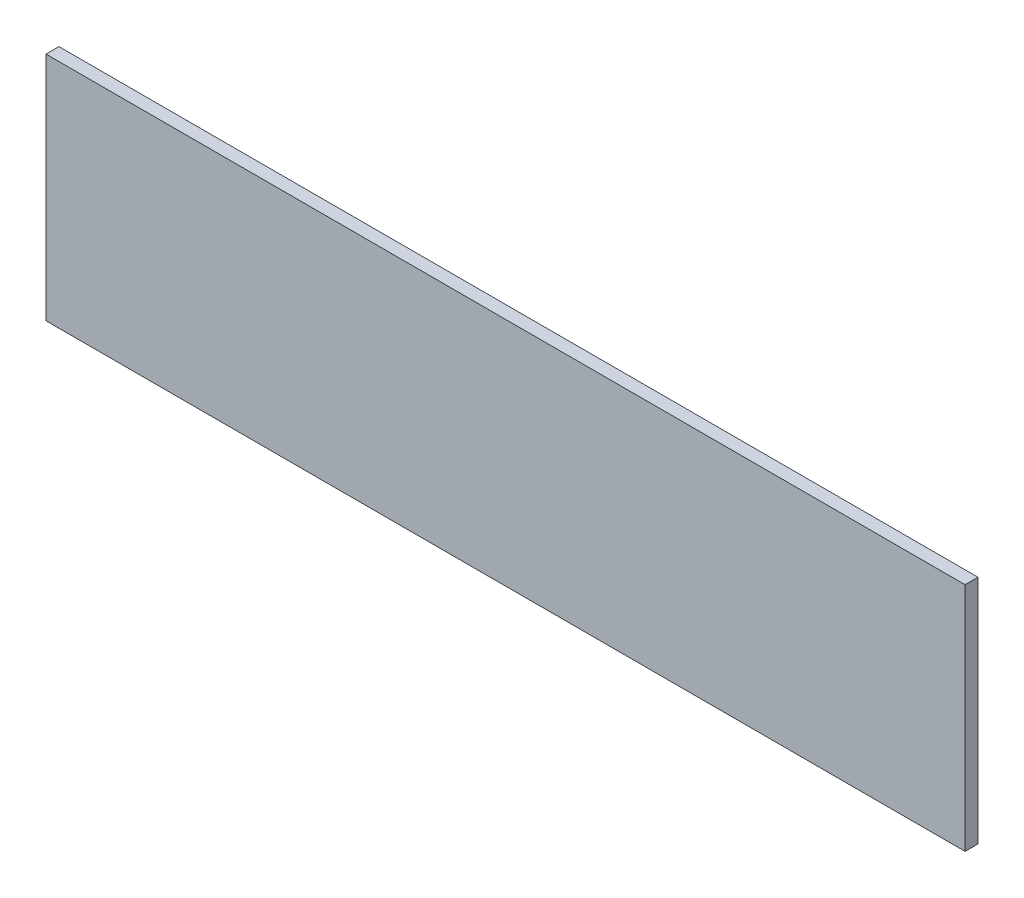
ISO-10303-21;
HEADER;
FILE_DESCRIPTION(('STEP AP214'),'2;1');
FILE_NAME('part.step','',(''),(''),'','','');
FILE_SCHEMA(('AUTOMOTIVE_DESIGN { 1 0 10303 214 1 1 1 1 }'));
ENDSEC;
DATA;
#1=APPLICATION_CONTEXT('core data for automotive mechanical design processes');
#2=APPLICATION_PROTOCOL_DEFINITION('international standard','automotive_design',2000,#1);
#3=PRODUCT_CONTEXT('',#1,'mechanical');
#4=PRODUCT('Part','Part','',(#3));
#5=PRODUCT_RELATED_PRODUCT_CATEGORY('part','',(#4));
#6=PRODUCT_DEFINITION_FORMATION('','',#4);
#7=PRODUCT_DEFINITION_CONTEXT('part definition',#1,'design');
#8=PRODUCT_DEFINITION('design','',#6,#7);
#9=PRODUCT_DEFINITION_SHAPE('','',#8);
#10=(LENGTH_UNIT() NAMED_UNIT(*) SI_UNIT(.MILLI.,.METRE.));
#11=(NAMED_UNIT(*) PLANE_ANGLE_UNIT() SI_UNIT($,.RADIAN.));
#12=(NAMED_UNIT(*) SI_UNIT($,.STERADIAN.) SOLID_ANGLE_UNIT());
#13=UNCERTAINTY_MEASURE_WITH_UNIT(LENGTH_MEASURE(1.E-05),#10,'distance_accuracy_value','');
#14=(GEOMETRIC_REPRESENTATION_CONTEXT(3) GLOBAL_UNCERTAINTY_ASSIGNED_CONTEXT((#13)) GLOBAL_UNIT_ASSIGNED_CONTEXT((#10,
#11,#12)) REPRESENTATION_CONTEXT('',''));
#15=CARTESIAN_POINT('',(0.,0.,0.));
#16=DIRECTION('',(0.,0.,1.));
#17=DIRECTION('',(1.,0.,0.));
#18=AXIS2_PLACEMENT_3D('',#15,#16,#17);
#19=CARTESIAN_POINT('',(0.9015984,0.22659848,0.));
#20=DIRECTION('',(1.,0.,0.));
#21=DIRECTION('',(0.,-1.,0.));
#22=AXIS2_PLACEMENT_3D('',#19,#20,#21);
#23=PLANE('',#22);
#24=DIRECTION('',(0.,0.,1.));
#25=VECTOR('',#24,1.);
#26=CARTESIAN_POINT('',(0.9015984,0.22659848,0.));
#27=LINE('',#26,#25);
#28=CARTESIAN_POINT('',(0.9015984,0.22659848,0.));
#29=VERTEX_POINT('',#28);
#30=CARTESIAN_POINT('',(0.9015984,0.22659848,0.0254));
#31=VERTEX_POINT('',#30);
#32=EDGE_CURVE('E11',#29,#31,#27,.T.);
#33=ORIENTED_EDGE('',*,*,#32,.T.);
#34=DIRECTION('',(0.,-1.,0.));
#35=VECTOR('',#34,1.);
#36=CARTESIAN_POINT('',(0.9015984,0.22659848,0.0254));
#37=LINE('',#36,#35);
#38=CARTESIAN_POINT('',(0.9015984,-0.22659848,0.0254));
#39=VERTEX_POINT('',#38);
#40=EDGE_CURVE('E24',#31,#39,#37,.T.);
#41=ORIENTED_EDGE('',*,*,#40,.T.);
#42=DIRECTION('',(0.,0.,1.));
#43=VECTOR('',#42,1.);
#44=CARTESIAN_POINT('',(0.9015984,-0.22659848,0.));
#45=LINE('',#44,#43);
#46=CARTESIAN_POINT('',(0.9015984,-0.22659848,0.));
#47=VERTEX_POINT('',#46);
#48=EDGE_CURVE('E85',#47,#39,#45,.T.);
#49=ORIENTED_EDGE('',*,*,#48,.F.);
#50=DIRECTION('',(0.,-1.,0.));
#51=VECTOR('',#50,1.);
#52=CARTESIAN_POINT('',(0.9015984,0.22659848,0.));
#53=LINE('',#52,#51);
#54=EDGE_CURVE('E83',#29,#47,#53,.T.);
#55=ORIENTED_EDGE('',*,*,#54,.F.);
#56=EDGE_LOOP('',(#33,#41,#49,#55));
#57=FACE_BOUND('',#56,.T.);
#58=ADVANCED_FACE('F17',(#57),#23,.T.);
#59=CARTESIAN_POINT('',(0.9015984,-0.22659848,0.));
#60=DIRECTION('',(0.,-1.,0.));
#61=DIRECTION('',(-1.,0.,0.));
#62=AXIS2_PLACEMENT_3D('',#59,#60,#61);
#63=PLANE('',#62);
#64=ORIENTED_EDGE('',*,*,#48,.T.);
#65=DIRECTION('',(-1.,0.,0.));
#66=VECTOR('',#65,1.);
#67=CARTESIAN_POINT('',(0.9015984,-0.22659848,0.0254));
#68=LINE('',#67,#66);
#69=CARTESIAN_POINT('',(-0.9015984,-0.22659848,0.0254));
#70=VERTEX_POINT('',#69);
#71=EDGE_CURVE('E81',#39,#70,#68,.T.);
#72=ORIENTED_EDGE('',*,*,#71,.T.);
#73=DIRECTION('',(0.,0.,1.));
#74=VECTOR('',#73,1.);
#75=CARTESIAN_POINT('',(-0.9015984,-0.22659848,0.));
#76=LINE('',#75,#74);
#77=CARTESIAN_POINT('',(-0.9015984,-0.22659848,0.));
#78=VERTEX_POINT('',#77);
#79=EDGE_CURVE('E79',#78,#70,#76,.T.);
#80=ORIENTED_EDGE('',*,*,#79,.F.);
#81=DIRECTION('',(-1.,0.,0.));
#82=VECTOR('',#81,1.);
#83=CARTESIAN_POINT('',(0.9015984,-0.22659848,0.));
#84=LINE('',#83,#82);
#85=EDGE_CURVE('E70',#47,#78,#84,.T.);
#86=ORIENTED_EDGE('',*,*,#85,.F.);
#87=EDGE_LOOP('',(#64,#72,#80,#86));
#88=FACE_BOUND('',#87,.T.);
#89=ADVANCED_FACE('F90',(#88),#63,.T.);
#90=CARTESIAN_POINT('',(-0.9015984,-0.22659848,0.));
#91=DIRECTION('',(-1.,0.,0.));
#92=DIRECTION('',(0.,1.,0.));
#93=AXIS2_PLACEMENT_3D('',#90,#91,#92);
#94=PLANE('',#93);
#95=ORIENTED_EDGE('',*,*,#79,.T.);
#96=DIRECTION('',(0.,1.,0.));
#97=VECTOR('',#96,1.);
#98=CARTESIAN_POINT('',(-0.9015984,-0.22659848,0.0254));
#99=LINE('',#98,#97);
#100=CARTESIAN_POINT('',(-0.9015984,0.22659848,0.0254));
#101=VERTEX_POINT('',#100);
#102=EDGE_CURVE('E60',#70,#101,#99,.T.);
#103=ORIENTED_EDGE('',*,*,#102,.T.);
#104=DIRECTION('',(0.,0.,1.));
#105=VECTOR('',#104,1.);
#106=CARTESIAN_POINT('',(-0.9015984,0.22659848,0.));
#107=LINE('',#106,#105);
#108=CARTESIAN_POINT('',(-0.9015984,0.22659848,0.));
#109=VERTEX_POINT('',#108);
#110=EDGE_CURVE('E54',#109,#101,#107,.T.);
#111=ORIENTED_EDGE('',*,*,#110,.F.);
#112=DIRECTION('',(0.,1.,0.));
#113=VECTOR('',#112,1.);
#114=CARTESIAN_POINT('',(-0.9015984,-0.22659848,0.));
#115=LINE('',#114,#113);
#116=EDGE_CURVE('E58',#78,#109,#115,.T.);
#117=ORIENTED_EDGE('',*,*,#116,.F.);
#118=EDGE_LOOP('',(#95,#103,#111,#117));
#119=FACE_BOUND('',#118,.T.);
#120=ADVANCED_FACE('F57',(#119),#94,.T.);
#121=CARTESIAN_POINT('',(-0.9015984,0.22659848,0.));
#122=DIRECTION('',(0.,1.,0.));
#123=DIRECTION('',(1.,0.,0.));
#124=AXIS2_PLACEMENT_3D('',#121,#122,#123);
#125=PLANE('',#124);
#126=ORIENTED_EDGE('',*,*,#110,.T.);
#127=DIRECTION('',(1.,0.,0.));
#128=VECTOR('',#127,1.);
#129=CARTESIAN_POINT('',(-0.9015984,0.22659848,0.0254));
#130=LINE('',#129,#128);
#131=EDGE_CURVE('E71',#101,#31,#130,.T.);
#132=ORIENTED_EDGE('',*,*,#131,.T.);
#133=ORIENTED_EDGE('',*,*,#32,.F.);
#134=DIRECTION('',(1.,0.,0.));
#135=VECTOR('',#134,1.);
#136=CARTESIAN_POINT('',(-0.9015984,0.22659848,0.));
#137=LINE('',#136,#135);
#138=EDGE_CURVE('E68',#109,#29,#137,.T.);
#139=ORIENTED_EDGE('',*,*,#138,.F.);
#140=EDGE_LOOP('',(#126,#132,#133,#139));
#141=FACE_BOUND('',#140,.T.);
#142=ADVANCED_FACE('F73',(#141),#125,.T.);
#143=CARTESIAN_POINT('',(0.9015984,0.22659848,0.));
#144=DIRECTION('',(0.,0.,1.));
#145=DIRECTION('',(1.,0.,0.));
#146=AXIS2_PLACEMENT_3D('',#143,#144,#145);
#147=PLANE('',#146);
#148=ORIENTED_EDGE('',*,*,#54,.T.);
#149=ORIENTED_EDGE('',*,*,#85,.T.);
#150=ORIENTED_EDGE('',*,*,#116,.T.);
#151=ORIENTED_EDGE('',*,*,#138,.T.);
#152=EDGE_LOOP('',(#148,#149,#150,#151));
#153=FACE_BOUND('',#152,.T.);
#154=ADVANCED_FACE('F67',(#153),#147,.F.);
#155=CARTESIAN_POINT('',(0.9015984,0.22659848,0.0254));
#156=DIRECTION('',(0.,0.,1.));
#157=DIRECTION('',(1.,0.,0.));
#158=AXIS2_PLACEMENT_3D('',#155,#156,#157);
#159=PLANE('',#158);
#160=ORIENTED_EDGE('',*,*,#131,.F.);
#161=ORIENTED_EDGE('',*,*,#102,.F.);
#162=ORIENTED_EDGE('',*,*,#71,.F.);
#163=ORIENTED_EDGE('',*,*,#40,.F.);
#164=EDGE_LOOP('',(#160,#161,#162,#163));
#165=FACE_BOUND('',#164,.T.);
#166=ADVANCED_FACE('F91',(#165),#159,.T.);
#167=CLOSED_SHELL('',(#58,#89,#120,#142,#154,#166));
#168=MANIFOLD_SOLID_BREP('B1',#167);
#169=ADVANCED_BREP_SHAPE_REPRESENTATION('',(#18,#168),#14);
#170=SHAPE_DEFINITION_REPRESENTATION(#9,#169);
ENDSEC;
END-ISO-10303-21;
